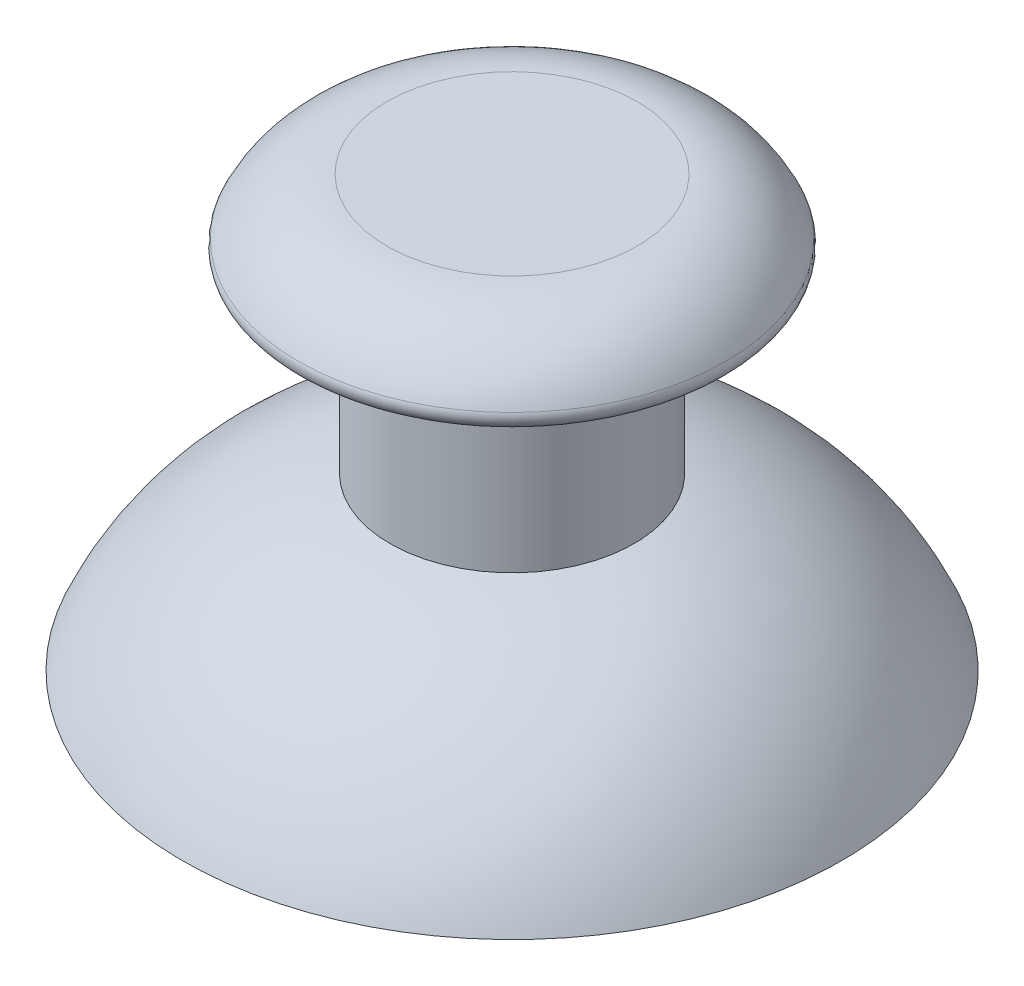
ISO-10303-21;
HEADER;
FILE_DESCRIPTION(('STEP AP214'),'2;1');
FILE_NAME('part.step','',(''),(''),'','','');
FILE_SCHEMA(('AUTOMOTIVE_DESIGN { 1 0 10303 214 1 1 1 1 }'));
ENDSEC;
DATA;
#1=APPLICATION_CONTEXT('core data for automotive mechanical design processes');
#2=APPLICATION_PROTOCOL_DEFINITION('international standard','automotive_design',2000,#1);
#3=PRODUCT_CONTEXT('',#1,'mechanical');
#4=PRODUCT('Part','Part','',(#3));
#5=PRODUCT_RELATED_PRODUCT_CATEGORY('part','',(#4));
#6=PRODUCT_DEFINITION_FORMATION('','',#4);
#7=PRODUCT_DEFINITION_CONTEXT('part definition',#1,'design');
#8=PRODUCT_DEFINITION('design','',#6,#7);
#9=PRODUCT_DEFINITION_SHAPE('','',#8);
#10=(LENGTH_UNIT() NAMED_UNIT(*) SI_UNIT(.MILLI.,.METRE.));
#11=(NAMED_UNIT(*) PLANE_ANGLE_UNIT() SI_UNIT($,.RADIAN.));
#12=(NAMED_UNIT(*) SI_UNIT($,.STERADIAN.) SOLID_ANGLE_UNIT());
#13=UNCERTAINTY_MEASURE_WITH_UNIT(LENGTH_MEASURE(1.E-05),#10,'distance_accuracy_value','');
#14=(GEOMETRIC_REPRESENTATION_CONTEXT(3) GLOBAL_UNCERTAINTY_ASSIGNED_CONTEXT((#13)) GLOBAL_UNIT_ASSIGNED_CONTEXT((#10,
#11,#12)) REPRESENTATION_CONTEXT('',''));
#15=CARTESIAN_POINT('',(0.,0.,0.));
#16=DIRECTION('',(0.,0.,1.));
#17=DIRECTION('',(1.,0.,0.));
#18=AXIS2_PLACEMENT_3D('',#15,#16,#17);
#19=CARTESIAN_POINT('',(0.,31.6178578918474,0.));
#20=DIRECTION('',(0.,1.,0.));
#21=DIRECTION('',(-1.,0.,0.));
#22=AXIS2_PLACEMENT_3D('',#19,#20,#21);
#23=PLANE('',#22);
#24=CARTESIAN_POINT('',(0.,31.6178578918474,0.));
#25=DIRECTION('',(0.,1.,0.));
#26=DIRECTION('',(-1.,0.,0.));
#27=AXIS2_PLACEMENT_3D('',#24,#25,#26);
#28=CIRCLE('',#27,5.12701665379258);
#29=CARTESIAN_POINT('',(-5.12701665379258,31.6178578918474,0.));
#30=VERTEX_POINT('',#29);
#31=EDGE_CURVE('E66',#30,#30,#28,.T.);
#32=ORIENTED_EDGE('',*,*,#31,.T.);
#33=EDGE_LOOP('',(#32));
#34=FACE_BOUND('',#33,.T.);
#35=ADVANCED_FACE('F37',(#34),#23,.T.);
#36=CARTESIAN_POINT('',(-4.78931777811703,20.0224453972373,0.));
#37=DIRECTION('',(0.,-1.,0.));
#38=DIRECTION('',(1.,0.,0.));
#39=AXIS2_PLACEMENT_3D('',#36,#37,#38);
#40=PLANE('',#39);
#41=CARTESIAN_POINT('',(0.,20.0224453972373,0.));
#42=DIRECTION('',(0.,1.,0.));
#43=DIRECTION('',(-1.,0.,0.));
#44=AXIS2_PLACEMENT_3D('',#41,#42,#43);
#45=CIRCLE('',#44,4.78931777811703);
#46=CARTESIAN_POINT('',(-4.78931777811703,20.0224453972373,0.));
#47=VERTEX_POINT('',#46);
#48=EDGE_CURVE('E48',#47,#47,#45,.T.);
#49=ORIENTED_EDGE('',*,*,#48,.F.);
#50=EDGE_LOOP('',(#49));
#51=FACE_BOUND('',#50,.T.);
#52=ADVANCED_FACE('F83',(#51),#40,.T.);
#53=CARTESIAN_POINT('',(0.,9.26934476684813,0.));
#54=DIRECTION('',(0.,1.,0.));
#55=DIRECTION('',(-1.,0.,0.));
#56=AXIS2_PLACEMENT_3D('',#53,#54,#55);
#57=DEGENERATE_TOROIDAL_SURFACE('',#56,2.47181333740434,11.,.T.);
#58=ORIENTED_EDGE('',*,*,#48,.T.);
#59=EDGE_LOOP('',(#58));
#60=FACE_BOUND('',#59,.T.);
#61=CARTESIAN_POINT('',(0.,14.,0.));
#62=DIRECTION('',(0.,1.,0.));
#63=DIRECTION('',(-1.,0.,0.));
#64=AXIS2_PLACEMENT_3D('',#61,#62,#63);
#65=CIRCLE('',#64,12.4026189978255);
#66=CARTESIAN_POINT('',(-12.4026189978255,14.,0.));
#67=VERTEX_POINT('',#66);
#68=EDGE_CURVE('E52',#67,#67,#65,.T.);
#69=ORIENTED_EDGE('',*,*,#68,.F.);
#70=EDGE_LOOP('',(#69));
#71=FACE_BOUND('',#70,.T.);
#72=ADVANCED_FACE('F87',(#60,#71),#57,.F.);
#73=CARTESIAN_POINT('',(-12.4026189978255,14.,0.));
#74=DIRECTION('',(0.,-1.,0.));
#75=DIRECTION('',(1.,0.,0.));
#76=AXIS2_PLACEMENT_3D('',#73,#74,#75);
#77=PLANE('',#76);
#78=ORIENTED_EDGE('',*,*,#68,.T.);
#79=EDGE_LOOP('',(#78));
#80=FACE_BOUND('',#79,.T.);
#81=CARTESIAN_POINT('',(0.,14.,0.));
#82=DIRECTION('',(0.,1.,0.));
#83=DIRECTION('',(-1.,0.,0.));
#84=AXIS2_PLACEMENT_3D('',#81,#82,#83);
#85=CIRCLE('',#84,13.5);
#86=CARTESIAN_POINT('',(-13.5,14.,0.));
#87=VERTEX_POINT('',#86);
#88=EDGE_CURVE('E57',#87,#87,#85,.T.);
#89=ORIENTED_EDGE('',*,*,#88,.F.);
#90=EDGE_LOOP('',(#89));
#91=FACE_BOUND('',#90,.T.);
#92=ADVANCED_FACE('F93',(#80,#91),#77,.T.);
#93=CARTESIAN_POINT('',(0.,9.26934476684813,0.));
#94=DIRECTION('',(0.,1.,0.));
#95=DIRECTION('',(-1.,0.,0.));
#96=AXIS2_PLACEMENT_3D('',#93,#94,#95);
#97=DEGENERATE_TOROIDAL_SURFACE('',#96,2.47181333740434,12.,.T.);
#98=ORIENTED_EDGE('',*,*,#88,.T.);
#99=EDGE_LOOP('',(#98));
#100=FACE_BOUND('',#99,.T.);
#101=CARTESIAN_POINT('',(0.,21.,0.));
#102=DIRECTION('',(0.,1.,0.));
#103=DIRECTION('',(-1.,0.,0.));
#104=AXIS2_PLACEMENT_3D('',#101,#102,#103);
#105=CIRCLE('',#104,5.);
#106=CARTESIAN_POINT('',(-5.,21.,0.));
#107=VERTEX_POINT('',#106);
#108=EDGE_CURVE('E60',#107,#107,#105,.T.);
#109=ORIENTED_EDGE('',*,*,#108,.F.);
#110=EDGE_LOOP('',(#109));
#111=FACE_BOUND('',#110,.T.);
#112=ADVANCED_FACE('F97',(#100,#111),#97,.T.);
#113=CARTESIAN_POINT('',(0.,31.6178578918474,0.));
#114=DIRECTION('',(0.,1.,0.));
#115=DIRECTION('',(-1.,0.,0.));
#116=AXIS2_PLACEMENT_3D('',#113,#114,#115);
#117=CYLINDRICAL_SURFACE('',#116,5.);
#118=ORIENTED_EDGE('',*,*,#108,.T.);
#119=EDGE_LOOP('',(#118));
#120=FACE_BOUND('',#119,.T.);
#121=CARTESIAN_POINT('',(0.,28.6178578918474,0.));
#122=DIRECTION('',(0.,1.,0.));
#123=DIRECTION('',(-1.,0.,0.));
#124=AXIS2_PLACEMENT_3D('',#121,#122,#123);
#125=CIRCLE('',#124,5.);
#126=CARTESIAN_POINT('',(-5.,28.6178578918474,0.));
#127=VERTEX_POINT('',#126);
#128=EDGE_CURVE('E63',#127,#127,#125,.T.);
#129=ORIENTED_EDGE('',*,*,#128,.F.);
#130=EDGE_LOOP('',(#129));
#131=FACE_BOUND('',#130,.T.);
#132=ADVANCED_FACE('F80',(#120,#131),#117,.T.);
#133=CARTESIAN_POINT('',(-5.,28.6178578918474,0.));
#134=DIRECTION('',(0.,-1.,0.));
#135=DIRECTION('',(1.,0.,0.));
#136=AXIS2_PLACEMENT_3D('',#133,#134,#135);
#137=PLANE('',#136);
#138=CARTESIAN_POINT('',(0.,28.6178578918474,0.));
#139=DIRECTION('',(0.,-1.,0.));
#140=DIRECTION('',(1.,0.,0.));
#141=AXIS2_PLACEMENT_3D('',#138,#139,#140);
#142=CIRCLE('',#141,8.28929431396097);
#143=CARTESIAN_POINT('',(8.28929431396097,28.6178578918474,0.));
#144=VERTEX_POINT('',#143);
#145=EDGE_CURVE('E10',#144,#144,#142,.T.);
#146=ORIENTED_EDGE('',*,*,#145,.T.);
#147=EDGE_LOOP('',(#146));
#148=FACE_BOUND('',#147,.T.);
#149=ORIENTED_EDGE('',*,*,#128,.T.);
#150=EDGE_LOOP('',(#149));
#151=FACE_BOUND('',#150,.T.);
#152=ADVANCED_FACE('F73',(#148,#151),#137,.T.);
#153=CARTESIAN_POINT('',(0.,27.6178578918474,0.));
#154=DIRECTION('',(0.,1.,0.));
#155=DIRECTION('',(-1.,0.,0.));
#156=AXIS2_PLACEMENT_3D('',#153,#154,#155);
#157=TOROIDAL_SURFACE('',#156,5.12701665379258,4.);
#158=CARTESIAN_POINT('',(0.,29.3321436061331,0.));
#159=DIRECTION('',(0.,-1.,0.));
#160=DIRECTION('',(1.,0.,0.));
#161=AXIS2_PLACEMENT_3D('',#158,#159,#160);
#162=CIRCLE('',#161,8.7410482654136);
#163=CARTESIAN_POINT('',(8.7410482654136,29.3321436061331,0.));
#164=VERTEX_POINT('',#163);
#165=EDGE_CURVE('E44',#164,#164,#162,.F.);
#166=ORIENTED_EDGE('',*,*,#165,.T.);
#167=EDGE_LOOP('',(#166));
#168=FACE_BOUND('',#167,.T.);
#169=ORIENTED_EDGE('',*,*,#31,.F.);
#170=EDGE_LOOP('',(#169));
#171=FACE_BOUND('',#170,.T.);
#172=ADVANCED_FACE('F71',(#168,#171),#157,.T.);
#173=CARTESIAN_POINT('',(0.,29.1178578918474,0.));
#174=DIRECTION('',(0.,-1.,0.));
#175=DIRECTION('',(1.,0.,0.));
#176=AXIS2_PLACEMENT_3D('',#173,#174,#175);
#177=TOROIDAL_SURFACE('',#176,8.28929431396097,0.5);
#178=ORIENTED_EDGE('',*,*,#145,.F.);
#179=EDGE_LOOP('',(#178));
#180=FACE_BOUND('',#179,.T.);
#181=ORIENTED_EDGE('',*,*,#165,.F.);
#182=EDGE_LOOP('',(#181));
#183=FACE_BOUND('',#182,.T.);
#184=ADVANCED_FACE('F39',(#180,#183),#177,.T.);
#185=CLOSED_SHELL('',(#35,#52,#72,#92,#112,#132,#152,#172,#184));
#186=MANIFOLD_SOLID_BREP('B2',#185);
#187=ADVANCED_BREP_SHAPE_REPRESENTATION('',(#18,#186),#14);
#188=SHAPE_DEFINITION_REPRESENTATION(#9,#187);
ENDSEC;
END-ISO-10303-21;
